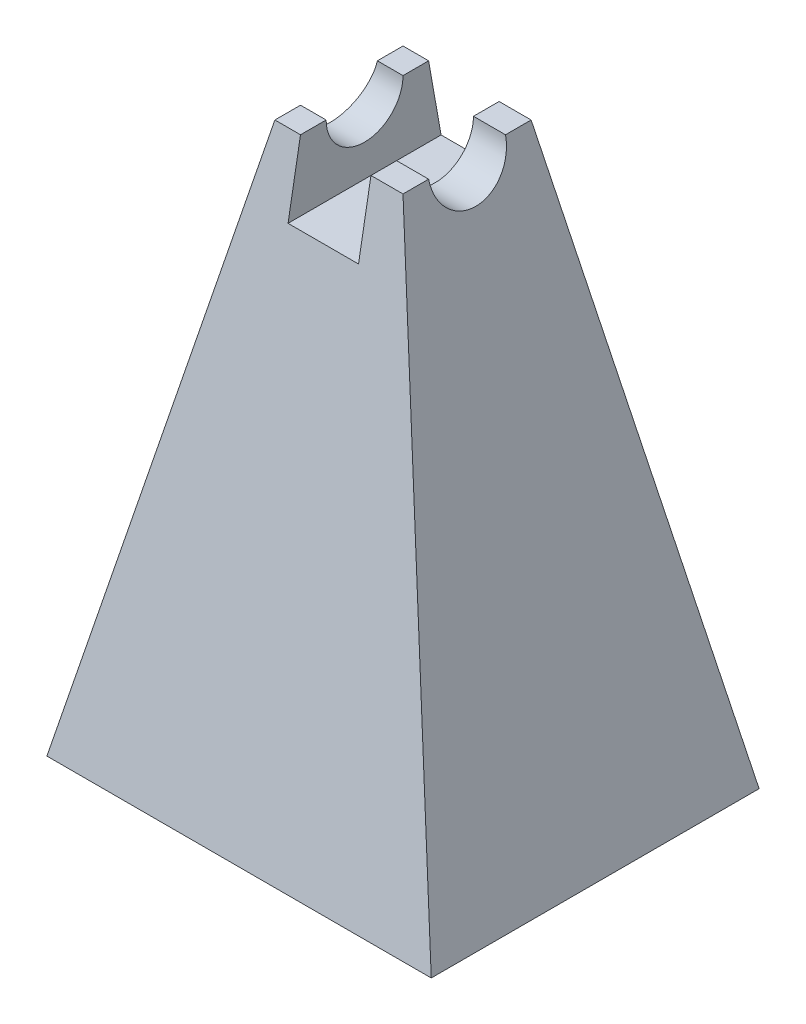
ISO-10303-21;
HEADER;
FILE_DESCRIPTION(('STEP AP214'),'2;1');
FILE_NAME('part.step','',(''),(''),'','','');
FILE_SCHEMA(('AUTOMOTIVE_DESIGN { 1 0 10303 214 1 1 1 1 }'));
ENDSEC;
DATA;
#1=APPLICATION_CONTEXT('core data for automotive mechanical design processes');
#2=APPLICATION_PROTOCOL_DEFINITION('international standard','automotive_design',2000,#1);
#3=PRODUCT_CONTEXT('',#1,'mechanical');
#4=PRODUCT('Part','Part','',(#3));
#5=PRODUCT_RELATED_PRODUCT_CATEGORY('part','',(#4));
#6=PRODUCT_DEFINITION_FORMATION('','',#4);
#7=PRODUCT_DEFINITION_CONTEXT('part definition',#1,'design');
#8=PRODUCT_DEFINITION('design','',#6,#7);
#9=PRODUCT_DEFINITION_SHAPE('','',#8);
#10=(LENGTH_UNIT() NAMED_UNIT(*) SI_UNIT(.MILLI.,.METRE.));
#11=(NAMED_UNIT(*) PLANE_ANGLE_UNIT() SI_UNIT($,.RADIAN.));
#12=(NAMED_UNIT(*) SI_UNIT($,.STERADIAN.) SOLID_ANGLE_UNIT());
#13=UNCERTAINTY_MEASURE_WITH_UNIT(LENGTH_MEASURE(1.E-05),#10,'distance_accuracy_value','');
#14=(GEOMETRIC_REPRESENTATION_CONTEXT(3) GLOBAL_UNCERTAINTY_ASSIGNED_CONTEXT((#13)) GLOBAL_UNIT_ASSIGNED_CONTEXT((#10,
#11,#12)) REPRESENTATION_CONTEXT('',''));
#15=CARTESIAN_POINT('',(0.,0.,0.));
#16=DIRECTION('',(0.,0.,1.));
#17=DIRECTION('',(1.,0.,0.));
#18=AXIS2_PLACEMENT_3D('',#15,#16,#17);
#19=CARTESIAN_POINT('',(-12.7,56.007,-65.000000048));
#20=DIRECTION('',(0.,1.,0.));
#21=DIRECTION('',(0.,0.,1.));
#22=AXIS2_PLACEMENT_3D('',#19,#20,#21);
#23=PLANE('',#22);
#24=DIRECTION('',(1.,0.,0.));
#25=VECTOR('',#24,1.);
#26=CARTESIAN_POINT('',(-38.1,56.007,-24.880000024));
#27=LINE('',#26,#25);
#28=CARTESIAN_POINT('',(6.34999999999999,56.007,-24.880000024));
#29=VERTEX_POINT('',#28);
#30=CARTESIAN_POINT('',(12.7,56.007,-24.880000024));
#31=VERTEX_POINT('',#30);
#32=EDGE_CURVE('E146',#29,#31,#27,.T.);
#33=ORIENTED_EDGE('',*,*,#32,.F.);
#34=DIRECTION('',(0.,0.,1.));
#35=VECTOR('',#34,1.);
#36=CARTESIAN_POINT('',(6.35,56.007,-65.000000048));
#37=LINE('',#36,#35);
#38=CARTESIAN_POINT('',(6.35,56.007,-19.800000024));
#39=VERTEX_POINT('',#38);
#40=EDGE_CURVE('E257',#29,#39,#37,.T.);
#41=ORIENTED_EDGE('',*,*,#40,.T.);
#42=DIRECTION('',(1.,0.,0.));
#43=VECTOR('',#42,1.);
#44=CARTESIAN_POINT('',(-38.1,56.007,-19.800000024));
#45=LINE('',#44,#43);
#46=CARTESIAN_POINT('',(12.7,56.007,-19.800000024));
#47=VERTEX_POINT('',#46);
#48=EDGE_CURVE('E200',#39,#47,#45,.T.);
#49=ORIENTED_EDGE('',*,*,#48,.T.);
#50=DIRECTION('',(0.,0.,1.));
#51=VECTOR('',#50,1.);
#52=CARTESIAN_POINT('',(12.7,56.007,-65.000000048));
#53=LINE('',#52,#51);
#54=EDGE_CURVE('E160',#31,#47,#53,.T.);
#55=ORIENTED_EDGE('',*,*,#54,.F.);
#56=EDGE_LOOP('',(#33,#41,#49,#55));
#57=FACE_BOUND('',#56,.T.);
#58=ADVANCED_FACE('F39',(#57),#23,.T.);
#59=CARTESIAN_POINT('',(-12.7,56.007,-24.880000024));
#60=VERTEX_POINT('',#59);
#61=CARTESIAN_POINT('',(-7.62,56.007,-24.880000024));
#62=VERTEX_POINT('',#61);
#63=EDGE_CURVE('E63',#60,#62,#27,.T.);
#64=ORIENTED_EDGE('',*,*,#63,.F.);
#65=DIRECTION('',(0.,0.,1.));
#66=VECTOR('',#65,1.);
#67=CARTESIAN_POINT('',(-12.7,56.007,-65.000000048));
#68=LINE('',#67,#66);
#69=CARTESIAN_POINT('',(-12.7,56.007,-19.800000024));
#70=VERTEX_POINT('',#69);
#71=EDGE_CURVE('E142',#60,#70,#68,.T.);
#72=ORIENTED_EDGE('',*,*,#71,.T.);
#73=CARTESIAN_POINT('',(-7.62,56.007,-19.800000024));
#74=VERTEX_POINT('',#73);
#75=EDGE_CURVE('E206',#70,#74,#45,.T.);
#76=ORIENTED_EDGE('',*,*,#75,.T.);
#77=DIRECTION('',(0.,0.,1.));
#78=VECTOR('',#77,1.);
#79=CARTESIAN_POINT('',(-7.62,56.007,-65.000000048));
#80=LINE('',#79,#78);
#81=EDGE_CURVE('E135',#62,#74,#80,.T.);
#82=ORIENTED_EDGE('',*,*,#81,.F.);
#83=EDGE_LOOP('',(#64,#72,#76,#82));
#84=FACE_BOUND('',#83,.T.);
#85=ADVANCED_FACE('F140',(#84),#23,.T.);
#86=DIRECTION('',(1.,0.,0.));
#87=VECTOR('',#86,1.);
#88=CARTESIAN_POINT('',(-38.1,56.007,-40.120000024));
#89=LINE('',#88,#87);
#90=CARTESIAN_POINT('',(6.35,56.007,-40.120000024));
#91=VERTEX_POINT('',#90);
#92=CARTESIAN_POINT('',(12.7,56.007,-40.120000024));
#93=VERTEX_POINT('',#92);
#94=EDGE_CURVE('E55',#91,#93,#89,.T.);
#95=ORIENTED_EDGE('',*,*,#94,.T.);
#96=CARTESIAN_POINT('',(12.7,56.007,-45.200000024));
#97=VERTEX_POINT('',#96);
#98=EDGE_CURVE('E154',#97,#93,#53,.T.);
#99=ORIENTED_EDGE('',*,*,#98,.F.);
#100=DIRECTION('',(1.,0.,0.));
#101=VECTOR('',#100,1.);
#102=CARTESIAN_POINT('',(-38.1,56.007,-45.200000024));
#103=LINE('',#102,#101);
#104=CARTESIAN_POINT('',(6.35,56.007,-45.200000024));
#105=VERTEX_POINT('',#104);
#106=EDGE_CURVE('E182',#105,#97,#103,.T.);
#107=ORIENTED_EDGE('',*,*,#106,.F.);
#108=EDGE_CURVE('E192',#105,#91,#37,.T.);
#109=ORIENTED_EDGE('',*,*,#108,.T.);
#110=EDGE_LOOP('',(#95,#99,#107,#109));
#111=FACE_BOUND('',#110,.T.);
#112=ADVANCED_FACE('F191',(#111),#23,.T.);
#113=CARTESIAN_POINT('',(38.1,-56.007,-65.000000048));
#114=DIRECTION('',(0.,-1.,0.));
#115=DIRECTION('',(0.,0.,-1.));
#116=AXIS2_PLACEMENT_3D('',#113,#114,#115);
#117=PLANE('',#116);
#118=DIRECTION('',(1.,0.,0.));
#119=VECTOR('',#118,1.);
#120=CARTESIAN_POINT('',(38.1,-56.007,0.));
#121=LINE('',#120,#119);
#122=CARTESIAN_POINT('',(-38.1,-56.007,0.));
#123=VERTEX_POINT('',#122);
#124=CARTESIAN_POINT('',(38.1,-56.007,0.));
#125=VERTEX_POINT('',#124);
#126=EDGE_CURVE('E219',#123,#125,#121,.T.);
#127=ORIENTED_EDGE('',*,*,#126,.F.);
#128=DIRECTION('',(0.,0.,1.));
#129=VECTOR('',#128,1.);
#130=CARTESIAN_POINT('',(-38.1,-56.007,-65.000000048));
#131=LINE('',#130,#129);
#132=CARTESIAN_POINT('',(-38.1,-56.007,-65.000000048));
#133=VERTEX_POINT('',#132);
#134=EDGE_CURVE('E158',#133,#123,#131,.T.);
#135=ORIENTED_EDGE('',*,*,#134,.F.);
#136=DIRECTION('',(1.,0.,0.));
#137=VECTOR('',#136,1.);
#138=CARTESIAN_POINT('',(38.1,-56.007,-65.000000048));
#139=LINE('',#138,#137);
#140=CARTESIAN_POINT('',(38.1,-56.007,-65.000000048));
#141=VERTEX_POINT('',#140);
#142=EDGE_CURVE('E169',#133,#141,#139,.T.);
#143=ORIENTED_EDGE('',*,*,#142,.T.);
#144=DIRECTION('',(0.,0.,1.));
#145=VECTOR('',#144,1.);
#146=CARTESIAN_POINT('',(38.1,-56.007,-65.000000048));
#147=LINE('',#146,#145);
#148=EDGE_CURVE('E165',#141,#125,#147,.T.);
#149=ORIENTED_EDGE('',*,*,#148,.T.);
#150=EDGE_LOOP('',(#127,#135,#143,#149));
#151=FACE_BOUND('',#150,.T.);
#152=ADVANCED_FACE('F41',(#151),#117,.T.);
#153=CARTESIAN_POINT('',(-38.1,-56.007,-65.000000048));
#154=DIRECTION('',(-0.975241355164484,0.221143164436391,0.));
#155=DIRECTION('',(-0.221143164436391,-0.975241355164484,0.));
#156=AXIS2_PLACEMENT_3D('',#153,#154,#155);
#157=PLANE('',#156);
#158=CARTESIAN_POINT('',(-12.7,56.007,-32.500000024));
#159=DIRECTION('',(-0.975241355164484,0.221143164436391,0.));
#160=DIRECTION('',(0.221143164436391,0.975241355164484,0.));
#161=AXIS2_PLACEMENT_3D('',#158,#159,#160);
#162=ELLIPSE('',#161,7.81345044449516,7.62);
#163=CARTESIAN_POINT('',(-12.7,56.007,-40.120000024));
#164=VERTEX_POINT('',#163);
#165=EDGE_CURVE('E126',#164,#60,#162,.T.);
#166=ORIENTED_EDGE('',*,*,#165,.F.);
#167=CARTESIAN_POINT('',(-12.7,56.007,-45.200000024));
#168=VERTEX_POINT('',#167);
#169=EDGE_CURVE('E153',#168,#164,#68,.T.);
#170=ORIENTED_EDGE('',*,*,#169,.F.);
#171=DIRECTION('',(0.217928739024918,0.96106573909989,0.169881458185971));
#172=VECTOR('',#171,1.);
#173=CARTESIAN_POINT('',(-38.1,-56.007,-65.000000048));
#174=LINE('',#173,#172);
#175=EDGE_CURVE('E216',#133,#168,#174,.T.);
#176=ORIENTED_EDGE('',*,*,#175,.F.);
#177=ORIENTED_EDGE('',*,*,#134,.T.);
#178=DIRECTION('',(-0.217928739024918,-0.96106573909989,0.169881458185971));
#179=VECTOR('',#178,1.);
#180=CARTESIAN_POINT('',(-35.693566620421,-45.3946287960568,-1.87588114068574));
#181=LINE('',#180,#179);
#182=EDGE_CURVE('E151',#70,#123,#181,.T.);
#183=ORIENTED_EDGE('',*,*,#182,.F.);
#184=ORIENTED_EDGE('',*,*,#71,.F.);
#185=EDGE_LOOP('',(#166,#170,#176,#177,#183,#184));
#186=FACE_BOUND('',#185,.T.);
#187=ADVANCED_FACE('F149',(#186),#157,.T.);
#188=CARTESIAN_POINT('',(-7.62000000000001,56.007,-40.120000024));
#189=VERTEX_POINT('',#188);
#190=EDGE_CURVE('E129',#164,#189,#89,.T.);
#191=ORIENTED_EDGE('',*,*,#190,.T.);
#192=CARTESIAN_POINT('',(-7.62,56.007,-45.200000024));
#193=VERTEX_POINT('',#192);
#194=EDGE_CURVE('E242',#193,#189,#80,.T.);
#195=ORIENTED_EDGE('',*,*,#194,.F.);
#196=EDGE_CURVE('E194',#168,#193,#103,.T.);
#197=ORIENTED_EDGE('',*,*,#196,.F.);
#198=ORIENTED_EDGE('',*,*,#169,.T.);
#199=EDGE_LOOP('',(#191,#195,#197,#198));
#200=FACE_BOUND('',#199,.T.);
#201=ADVANCED_FACE('F239',(#200),#23,.T.);
#202=CARTESIAN_POINT('',(12.7,56.007,-65.000000048));
#203=DIRECTION('',(0.975241355164484,0.221143164436391,0.));
#204=DIRECTION('',(-0.221143164436391,0.975241355164484,0.));
#205=AXIS2_PLACEMENT_3D('',#202,#203,#204);
#206=PLANE('',#205);
#207=CARTESIAN_POINT('',(12.7,56.007,-32.500000024));
#208=DIRECTION('',(0.975241355164484,0.221143164436391,0.));
#209=DIRECTION('',(0.221143164436391,-0.975241355164484,0.));
#210=AXIS2_PLACEMENT_3D('',#207,#208,#209);
#211=ELLIPSE('',#210,7.81345044449516,7.62);
#212=EDGE_CURVE('E136',#31,#93,#211,.T.);
#213=ORIENTED_EDGE('',*,*,#212,.F.);
#214=ORIENTED_EDGE('',*,*,#54,.T.);
#215=DIRECTION('',(-0.217928739024918,0.96106573909989,-0.169881458185971));
#216=VECTOR('',#215,1.);
#217=CARTESIAN_POINT('',(11.02660325024,63.3866796664416,-21.1044589092523));
#218=LINE('',#217,#216);
#219=EDGE_CURVE('E207',#125,#47,#218,.T.);
#220=ORIENTED_EDGE('',*,*,#219,.F.);
#221=ORIENTED_EDGE('',*,*,#148,.F.);
#222=DIRECTION('',(0.217928739024918,-0.96106573909989,-0.169881458185971));
#223=VECTOR('',#222,1.);
#224=CARTESIAN_POINT('',(13.433036629819,52.7743084624984,-45.7714222794334));
#225=LINE('',#224,#223);
#226=EDGE_CURVE('E213',#97,#141,#225,.T.);
#227=ORIENTED_EDGE('',*,*,#226,.F.);
#228=ORIENTED_EDGE('',*,*,#98,.T.);
#229=EDGE_LOOP('',(#213,#214,#220,#221,#227,#228));
#230=FACE_BOUND('',#229,.T.);
#231=ADVANCED_FACE('F233',(#230),#206,.T.);
#232=CARTESIAN_POINT('',(-38.1,-56.007,0.));
#233=DIRECTION('',(0.,-0.174065169513809,-0.984734135064957));
#234=DIRECTION('',(0.,0.984734135064957,-0.174065169513809));
#235=AXIS2_PLACEMENT_3D('',#232,#233,#234);
#236=PLANE('',#235);
#237=ORIENTED_EDGE('',*,*,#48,.F.);
#238=DIRECTION('',(0.,-0.984734135064957,0.174065169513809));
#239=VECTOR('',#238,1.);
#240=CARTESIAN_POINT('',(6.34999999999999,-56.007,0.));
#241=LINE('',#240,#239);
#242=CARTESIAN_POINT('',(6.35,42.037,-17.3306122659048));
#243=VERTEX_POINT('',#242);
#244=EDGE_CURVE('E195',#39,#243,#241,.T.);
#245=ORIENTED_EDGE('',*,*,#244,.T.);
#246=DIRECTION('',(-1.,0.,0.));
#247=VECTOR('',#246,1.);
#248=CARTESIAN_POINT('',(-38.1,42.037,-17.3306122659048));
#249=LINE('',#248,#247);
#250=CARTESIAN_POINT('',(-7.62,42.037,-17.3306122659048));
#251=VERTEX_POINT('',#250);
#252=EDGE_CURVE('E202',#243,#251,#249,.T.);
#253=ORIENTED_EDGE('',*,*,#252,.T.);
#254=DIRECTION('',(0.,0.984734135064957,-0.174065169513809));
#255=VECTOR('',#254,1.);
#256=CARTESIAN_POINT('',(-7.61999999999998,-56.007,0.));
#257=LINE('',#256,#255);
#258=EDGE_CURVE('E248',#251,#74,#257,.T.);
#259=ORIENTED_EDGE('',*,*,#258,.T.);
#260=ORIENTED_EDGE('',*,*,#75,.F.);
#261=ORIENTED_EDGE('',*,*,#182,.T.);
#262=ORIENTED_EDGE('',*,*,#126,.T.);
#263=ORIENTED_EDGE('',*,*,#219,.T.);
#264=EDGE_LOOP('',(#237,#245,#253,#259,#260,#261,#262,#263));
#265=FACE_BOUND('',#264,.T.);
#266=ADVANCED_FACE('F227',(#265),#236,.F.);
#267=CARTESIAN_POINT('',(-38.1,-56.007,-65.000000048));
#268=DIRECTION('',(0.,-0.174065169513809,0.984734135064957));
#269=DIRECTION('',(0.,-0.984734135064957,-0.174065169513809));
#270=AXIS2_PLACEMENT_3D('',#267,#268,#269);
#271=PLANE('',#270);
#272=DIRECTION('',(1.,0.,0.));
#273=VECTOR('',#272,1.);
#274=CARTESIAN_POINT('',(-38.1,42.037,-47.6693877820952));
#275=LINE('',#274,#273);
#276=CARTESIAN_POINT('',(-7.62,42.037,-47.6693877820952));
#277=VERTEX_POINT('',#276);
#278=CARTESIAN_POINT('',(6.35,42.037,-47.6693877820952));
#279=VERTEX_POINT('',#278);
#280=EDGE_CURVE('E174',#277,#279,#275,.T.);
#281=ORIENTED_EDGE('',*,*,#280,.T.);
#282=DIRECTION('',(0.,0.984734135064957,0.174065169513809));
#283=VECTOR('',#282,1.);
#284=CARTESIAN_POINT('',(6.34999999999999,-56.007,-65.000000048));
#285=LINE('',#284,#283);
#286=EDGE_CURVE('E48',#279,#105,#285,.T.);
#287=ORIENTED_EDGE('',*,*,#286,.T.);
#288=ORIENTED_EDGE('',*,*,#106,.T.);
#289=ORIENTED_EDGE('',*,*,#226,.T.);
#290=ORIENTED_EDGE('',*,*,#142,.F.);
#291=ORIENTED_EDGE('',*,*,#175,.T.);
#292=ORIENTED_EDGE('',*,*,#196,.T.);
#293=DIRECTION('',(0.,-0.984734135064957,-0.174065169513809));
#294=VECTOR('',#293,1.);
#295=CARTESIAN_POINT('',(-7.61999999999998,-56.007,-65.000000048));
#296=LINE('',#295,#294);
#297=EDGE_CURVE('E170',#193,#277,#296,.T.);
#298=ORIENTED_EDGE('',*,*,#297,.T.);
#299=EDGE_LOOP('',(#281,#287,#288,#289,#290,#291,#292,#298));
#300=FACE_BOUND('',#299,.T.);
#301=ADVANCED_FACE('F181',(#300),#271,.F.);
#302=CARTESIAN_POINT('',(6.35,42.037,-65.000000048));
#303=DIRECTION('',(1.,0.,0.));
#304=DIRECTION('',(0.,1.,0.));
#305=AXIS2_PLACEMENT_3D('',#302,#303,#304);
#306=PLANE('',#305);
#307=ORIENTED_EDGE('',*,*,#40,.F.);
#308=CARTESIAN_POINT('',(6.35,56.007,-32.500000024));
#309=DIRECTION('',(1.,0.,0.));
#310=DIRECTION('',(0.,1.,0.));
#311=AXIS2_PLACEMENT_3D('',#308,#309,#310);
#312=CIRCLE('',#311,7.62);
#313=EDGE_CURVE('E145',#29,#91,#312,.T.);
#314=ORIENTED_EDGE('',*,*,#313,.T.);
#315=ORIENTED_EDGE('',*,*,#108,.F.);
#316=ORIENTED_EDGE('',*,*,#286,.F.);
#317=DIRECTION('',(0.,0.,1.));
#318=VECTOR('',#317,1.);
#319=CARTESIAN_POINT('',(6.35,42.037,-65.000000048));
#320=LINE('',#319,#318);
#321=EDGE_CURVE('E252',#279,#243,#320,.T.);
#322=ORIENTED_EDGE('',*,*,#321,.T.);
#323=ORIENTED_EDGE('',*,*,#244,.F.);
#324=EDGE_LOOP('',(#307,#314,#315,#316,#322,#323));
#325=FACE_BOUND('',#324,.T.);
#326=ADVANCED_FACE('F268',(#325),#306,.F.);
#327=CARTESIAN_POINT('',(-7.62,42.037,-65.000000048));
#328=DIRECTION('',(0.,-1.,0.));
#329=DIRECTION('',(0.,0.,-1.));
#330=AXIS2_PLACEMENT_3D('',#327,#328,#329);
#331=PLANE('',#330);
#332=ORIENTED_EDGE('',*,*,#321,.F.);
#333=ORIENTED_EDGE('',*,*,#280,.F.);
#334=DIRECTION('',(0.,0.,1.));
#335=VECTOR('',#334,1.);
#336=CARTESIAN_POINT('',(-7.62,42.037,-65.000000048));
#337=LINE('',#336,#335);
#338=EDGE_CURVE('E246',#277,#251,#337,.T.);
#339=ORIENTED_EDGE('',*,*,#338,.T.);
#340=ORIENTED_EDGE('',*,*,#252,.F.);
#341=EDGE_LOOP('',(#332,#333,#339,#340));
#342=FACE_BOUND('',#341,.T.);
#343=ADVANCED_FACE('F254',(#342),#331,.F.);
#344=CARTESIAN_POINT('',(-7.62,56.007,-65.000000048));
#345=DIRECTION('',(-1.,0.,0.));
#346=DIRECTION('',(0.,-1.,0.));
#347=AXIS2_PLACEMENT_3D('',#344,#345,#346);
#348=PLANE('',#347);
#349=ORIENTED_EDGE('',*,*,#194,.T.);
#350=CARTESIAN_POINT('',(-7.62,56.007,-32.500000024));
#351=DIRECTION('',(-1.,0.,0.));
#352=DIRECTION('',(0.,-1.,0.));
#353=AXIS2_PLACEMENT_3D('',#350,#351,#352);
#354=CIRCLE('',#353,7.62);
#355=EDGE_CURVE('E11',#189,#62,#354,.T.);
#356=ORIENTED_EDGE('',*,*,#355,.T.);
#357=ORIENTED_EDGE('',*,*,#81,.T.);
#358=ORIENTED_EDGE('',*,*,#258,.F.);
#359=ORIENTED_EDGE('',*,*,#338,.F.);
#360=ORIENTED_EDGE('',*,*,#297,.F.);
#361=EDGE_LOOP('',(#349,#356,#357,#358,#359,#360));
#362=FACE_BOUND('',#361,.T.);
#363=ADVANCED_FACE('F244',(#362),#348,.F.);
#364=CARTESIAN_POINT('',(-38.1,56.007,-32.500000024));
#365=DIRECTION('',(1.,0.,0.));
#366=DIRECTION('',(0.,0.,-1.));
#367=AXIS2_PLACEMENT_3D('',#364,#365,#366);
#368=CYLINDRICAL_SURFACE('',#367,7.62);
#369=ORIENTED_EDGE('',*,*,#165,.T.);
#370=ORIENTED_EDGE('',*,*,#63,.T.);
#371=ORIENTED_EDGE('',*,*,#355,.F.);
#372=ORIENTED_EDGE('',*,*,#190,.F.);
#373=EDGE_LOOP('',(#369,#370,#371,#372));
#374=FACE_BOUND('',#373,.T.);
#375=ADVANCED_FACE('F127',(#374),#368,.F.);
#376=ORIENTED_EDGE('',*,*,#212,.T.);
#377=ORIENTED_EDGE('',*,*,#94,.F.);
#378=ORIENTED_EDGE('',*,*,#313,.F.);
#379=ORIENTED_EDGE('',*,*,#32,.T.);
#380=EDGE_LOOP('',(#376,#377,#378,#379));
#381=FACE_BOUND('',#380,.T.);
#382=ADVANCED_FACE('F279',(#381),#368,.F.);
#383=CLOSED_SHELL('',(#58,#85,#112,#152,#187,#201,#231,#266,#301,#326,#343,#363,#375,#382));
#384=MANIFOLD_SOLID_BREP('B2',#383);
#385=ADVANCED_BREP_SHAPE_REPRESENTATION('',(#18,#384),#14);
#386=SHAPE_DEFINITION_REPRESENTATION(#9,#385);
ENDSEC;
END-ISO-10303-21;
